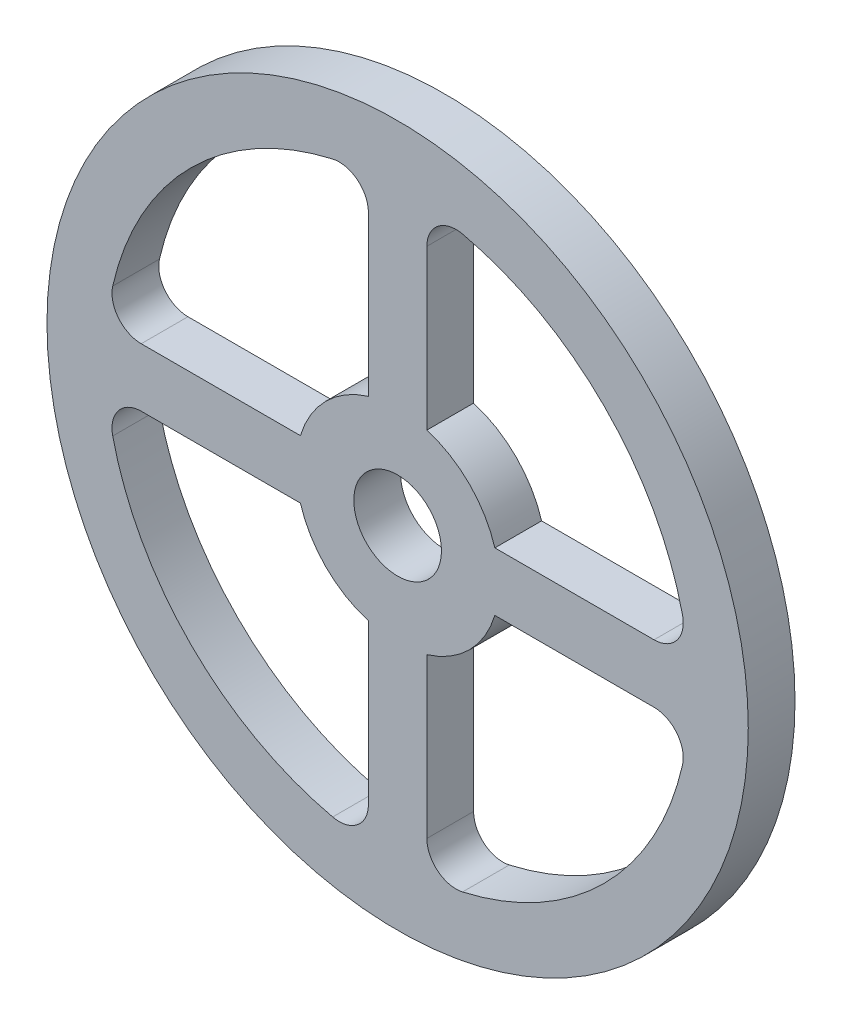
ISO-10303-21;
HEADER;
FILE_DESCRIPTION(('STEP AP214'),'2;1');
FILE_NAME('part.step','',(''),(''),'','','');
FILE_SCHEMA(('AUTOMOTIVE_DESIGN { 1 0 10303 214 1 1 1 1 }'));
ENDSEC;
DATA;
#1=APPLICATION_CONTEXT('core data for automotive mechanical design processes');
#2=APPLICATION_PROTOCOL_DEFINITION('international standard','automotive_design',2000,#1);
#3=PRODUCT_CONTEXT('',#1,'mechanical');
#4=PRODUCT('Part','Part','',(#3));
#5=PRODUCT_RELATED_PRODUCT_CATEGORY('part','',(#4));
#6=PRODUCT_DEFINITION_FORMATION('','',#4);
#7=PRODUCT_DEFINITION_CONTEXT('part definition',#1,'design');
#8=PRODUCT_DEFINITION('design','',#6,#7);
#9=PRODUCT_DEFINITION_SHAPE('','',#8);
#10=(LENGTH_UNIT() NAMED_UNIT(*) SI_UNIT(.MILLI.,.METRE.));
#11=(NAMED_UNIT(*) PLANE_ANGLE_UNIT() SI_UNIT($,.RADIAN.));
#12=(NAMED_UNIT(*) SI_UNIT($,.STERADIAN.) SOLID_ANGLE_UNIT());
#13=UNCERTAINTY_MEASURE_WITH_UNIT(LENGTH_MEASURE(1.E-05),#10,'distance_accuracy_value','');
#14=(GEOMETRIC_REPRESENTATION_CONTEXT(3) GLOBAL_UNCERTAINTY_ASSIGNED_CONTEXT((#13)) GLOBAL_UNIT_ASSIGNED_CONTEXT((#10,
#11,#12)) REPRESENTATION_CONTEXT('',''));
#15=CARTESIAN_POINT('',(0.,0.,0.));
#16=DIRECTION('',(0.,0.,1.));
#17=DIRECTION('',(1.,0.,0.));
#18=AXIS2_PLACEMENT_3D('',#15,#16,#17);
#19=CARTESIAN_POINT('',(0.,0.,16.));
#20=DIRECTION('',(0.,0.,1.));
#21=DIRECTION('',(1.,0.,0.));
#22=AXIS2_PLACEMENT_3D('',#19,#20,#21);
#23=PLANE('',#22);
#24=DIRECTION('',(-1.,0.,0.));
#25=VECTOR('',#24,1.);
#26=CARTESIAN_POINT('',(33.2681518949643,-9.99999999999999,16.));
#27=LINE('',#26,#25);
#28=CARTESIAN_POINT('',(87.7454370086416,-9.99999999999999,16.));
#29=VERTEX_POINT('',#28);
#30=CARTESIAN_POINT('',(33.2681518949643,-9.99999999999999,16.));
#31=VERTEX_POINT('',#30);
#32=EDGE_CURVE('E347',#29,#31,#27,.T.);
#33=ORIENTED_EDGE('',*,*,#32,.F.);
#34=CARTESIAN_POINT('',(87.7454370086416,-20.,16.));
#35=DIRECTION('',(0.,0.,1.));
#36=DIRECTION('',(-1.,0.,0.));
#37=AXIS2_PLACEMENT_3D('',#34,#35,#36);
#38=CIRCLE('',#37,10.);
#39=CARTESIAN_POINT('',(97.4953743545621,-22.2223235026934,16.));
#40=VERTEX_POINT('',#39);
#41=EDGE_CURVE('E345',#40,#29,#38,.T.);
#42=ORIENTED_EDGE('',*,*,#41,.F.);
#43=CARTESIAN_POINT('',(0.,0.,16.));
#44=DIRECTION('',(0.,0.,1.));
#45=DIRECTION('',(1.,0.,0.));
#46=AXIS2_PLACEMENT_3D('',#43,#44,#45);
#47=CIRCLE('',#46,99.9958983278543);
#48=CARTESIAN_POINT('',(22.2223235026933,-97.4953743545622,16.));
#49=VERTEX_POINT('',#48);
#50=EDGE_CURVE('E357',#49,#40,#47,.T.);
#51=ORIENTED_EDGE('',*,*,#50,.F.);
#52=CARTESIAN_POINT('',(19.9999999999999,-87.7454370086416,16.));
#53=DIRECTION('',(0.,0.,1.));
#54=DIRECTION('',(1.,0.,0.));
#55=AXIS2_PLACEMENT_3D('',#52,#53,#54);
#56=CIRCLE('',#55,10.);
#57=CARTESIAN_POINT('',(9.99999999999991,-87.7454370086416,16.));
#58=VERTEX_POINT('',#57);
#59=EDGE_CURVE('E354',#58,#49,#56,.T.);
#60=ORIENTED_EDGE('',*,*,#59,.F.);
#61=DIRECTION('',(0.,-1.,0.));
#62=VECTOR('',#61,1.);
#63=CARTESIAN_POINT('',(9.99999999999991,-33.2681518949644,16.));
#64=LINE('',#63,#62);
#65=CARTESIAN_POINT('',(9.9999999999999,-33.2681518949643,16.));
#66=VERTEX_POINT('',#65);
#67=EDGE_CURVE('E352',#66,#58,#64,.T.);
#68=ORIENTED_EDGE('',*,*,#67,.F.);
#69=CARTESIAN_POINT('',(0.,0.,16.));
#70=DIRECTION('',(0.,0.,-1.));
#71=DIRECTION('',(1.,0.,0.));
#72=AXIS2_PLACEMENT_3D('',#69,#70,#71);
#73=CIRCLE('',#72,34.7385942505798);
#74=EDGE_CURVE('E350',#31,#66,#73,.T.);
#75=ORIENTED_EDGE('',*,*,#74,.F.);
#76=EDGE_LOOP('',(#33,#42,#51,#60,#68,#75));
#77=FACE_BOUND('',#76,.T.);
#78=CARTESIAN_POINT('',(0.,0.,16.));
#79=DIRECTION('',(0.,0.,1.));
#80=DIRECTION('',(1.,0.,0.));
#81=AXIS2_PLACEMENT_3D('',#78,#79,#80);
#82=CIRCLE('',#81,120.);
#83=CARTESIAN_POINT('',(120.,0.,16.));
#84=VERTEX_POINT('',#83);
#85=EDGE_CURVE('E11',#84,#84,#82,.T.);
#86=ORIENTED_EDGE('',*,*,#85,.T.);
#87=EDGE_LOOP('',(#86));
#88=FACE_BOUND('',#87,.T.);
#89=CARTESIAN_POINT('',(0.,0.,16.));
#90=DIRECTION('',(0.,0.,1.));
#91=DIRECTION('',(1.,0.,0.));
#92=AXIS2_PLACEMENT_3D('',#89,#90,#91);
#93=CIRCLE('',#92,15.);
#94=CARTESIAN_POINT('',(15.,0.,16.));
#95=VERTEX_POINT('',#94);
#96=EDGE_CURVE('E339',#95,#95,#93,.T.);
#97=ORIENTED_EDGE('',*,*,#96,.F.);
#98=EDGE_LOOP('',(#97));
#99=FACE_BOUND('',#98,.T.);
#100=DIRECTION('',(1.,0.,0.));
#101=VECTOR('',#100,1.);
#102=CARTESIAN_POINT('',(33.2681518949643,10.,16.));
#103=LINE('',#102,#101);
#104=CARTESIAN_POINT('',(33.2681518949643,10.,16.));
#105=VERTEX_POINT('',#104);
#106=CARTESIAN_POINT('',(87.7454370086416,10.,16.));
#107=VERTEX_POINT('',#106);
#108=EDGE_CURVE('E296',#105,#107,#103,.T.);
#109=ORIENTED_EDGE('',*,*,#108,.F.);
#110=CARTESIAN_POINT('',(0.,0.,16.));
#111=DIRECTION('',(0.,0.,-1.));
#112=DIRECTION('',(1.,0.,0.));
#113=AXIS2_PLACEMENT_3D('',#110,#111,#112);
#114=CIRCLE('',#113,34.7385942505798);
#115=CARTESIAN_POINT('',(9.99999999999991,33.2681518949644,16.));
#116=VERTEX_POINT('',#115);
#117=EDGE_CURVE('E294',#116,#105,#114,.T.);
#118=ORIENTED_EDGE('',*,*,#117,.F.);
#119=DIRECTION('',(0.,-1.,0.));
#120=VECTOR('',#119,1.);
#121=CARTESIAN_POINT('',(9.99999999999991,87.7454370086416,16.));
#122=LINE('',#121,#120);
#123=CARTESIAN_POINT('',(9.99999999999991,87.7454370086416,16.));
#124=VERTEX_POINT('',#123);
#125=EDGE_CURVE('E306',#124,#116,#122,.T.);
#126=ORIENTED_EDGE('',*,*,#125,.F.);
#127=CARTESIAN_POINT('',(19.9999999999999,87.7454370086416,16.));
#128=DIRECTION('',(0.,0.,1.));
#129=DIRECTION('',(-1.,0.,0.));
#130=AXIS2_PLACEMENT_3D('',#127,#128,#129);
#131=CIRCLE('',#130,10.);
#132=CARTESIAN_POINT('',(22.2223235026933,97.4953743545622,16.));
#133=VERTEX_POINT('',#132);
#134=EDGE_CURVE('E303',#133,#124,#131,.T.);
#135=ORIENTED_EDGE('',*,*,#134,.F.);
#136=CARTESIAN_POINT('',(0.,0.,16.));
#137=DIRECTION('',(0.,0.,1.));
#138=DIRECTION('',(1.,0.,0.));
#139=AXIS2_PLACEMENT_3D('',#136,#137,#138);
#140=CIRCLE('',#139,99.9958983278543);
#141=CARTESIAN_POINT('',(97.4953743545621,22.2223235026934,16.));
#142=VERTEX_POINT('',#141);
#143=EDGE_CURVE('E301',#142,#133,#140,.T.);
#144=ORIENTED_EDGE('',*,*,#143,.F.);
#145=CARTESIAN_POINT('',(87.7454370086416,20.,16.));
#146=DIRECTION('',(0.,0.,1.));
#147=DIRECTION('',(1.,0.,0.));
#148=AXIS2_PLACEMENT_3D('',#145,#146,#147);
#149=CIRCLE('',#148,9.99999999999998);
#150=EDGE_CURVE('E299',#107,#142,#149,.T.);
#151=ORIENTED_EDGE('',*,*,#150,.F.);
#152=EDGE_LOOP('',(#109,#118,#126,#135,#144,#151));
#153=FACE_BOUND('',#152,.T.);
#154=DIRECTION('',(0.,1.,0.));
#155=VECTOR('',#154,1.);
#156=CARTESIAN_POINT('',(-10.0000000000001,87.7454370086415,16.));
#157=LINE('',#156,#155);
#158=CARTESIAN_POINT('',(-10.0000000000001,33.2681518949643,16.));
#159=VERTEX_POINT('',#158);
#160=CARTESIAN_POINT('',(-10.0000000000001,87.7454370086415,16.));
#161=VERTEX_POINT('',#160);
#162=EDGE_CURVE('E251',#159,#161,#157,.T.);
#163=ORIENTED_EDGE('',*,*,#162,.F.);
#164=CARTESIAN_POINT('',(0.,0.,16.));
#165=DIRECTION('',(0.,0.,-1.));
#166=DIRECTION('',(1.,0.,0.));
#167=AXIS2_PLACEMENT_3D('',#164,#165,#166);
#168=CIRCLE('',#167,34.7385942505798);
#169=CARTESIAN_POINT('',(-33.2681518949643,10.,16.));
#170=VERTEX_POINT('',#169);
#171=EDGE_CURVE('E249',#170,#159,#168,.T.);
#172=ORIENTED_EDGE('',*,*,#171,.F.);
#173=DIRECTION('',(1.,0.,0.));
#174=VECTOR('',#173,1.);
#175=CARTESIAN_POINT('',(-87.7454370086416,10.,16.));
#176=LINE('',#175,#174);
#177=CARTESIAN_POINT('',(-87.7454370086416,10.,16.));
#178=VERTEX_POINT('',#177);
#179=EDGE_CURVE('E261',#178,#170,#176,.T.);
#180=ORIENTED_EDGE('',*,*,#179,.F.);
#181=CARTESIAN_POINT('',(-87.7454370086416,20.,16.));
#182=DIRECTION('',(0.,0.,1.));
#183=DIRECTION('',(-1.,0.,0.));
#184=AXIS2_PLACEMENT_3D('',#181,#182,#183);
#185=CIRCLE('',#184,9.99999999999998);
#186=CARTESIAN_POINT('',(-97.4953743545621,22.2223235026934,16.));
#187=VERTEX_POINT('',#186);
#188=EDGE_CURVE('E258',#187,#178,#185,.T.);
#189=ORIENTED_EDGE('',*,*,#188,.F.);
#190=CARTESIAN_POINT('',(0.,0.,16.));
#191=DIRECTION('',(0.,0.,1.));
#192=DIRECTION('',(1.,0.,0.));
#193=AXIS2_PLACEMENT_3D('',#190,#191,#192);
#194=CIRCLE('',#193,99.9958983278543);
#195=CARTESIAN_POINT('',(-22.2223235026935,97.4953743545621,16.));
#196=VERTEX_POINT('',#195);
#197=EDGE_CURVE('E256',#196,#187,#194,.T.);
#198=ORIENTED_EDGE('',*,*,#197,.F.);
#199=CARTESIAN_POINT('',(-20.0000000000001,87.7454370086415,16.));
#200=DIRECTION('',(0.,0.,1.));
#201=DIRECTION('',(1.,0.,0.));
#202=AXIS2_PLACEMENT_3D('',#199,#200,#201);
#203=CIRCLE('',#202,10.);
#204=EDGE_CURVE('E254',#161,#196,#203,.T.);
#205=ORIENTED_EDGE('',*,*,#204,.F.);
#206=EDGE_LOOP('',(#163,#172,#180,#189,#198,#205));
#207=FACE_BOUND('',#206,.T.);
#208=DIRECTION('',(-1.,0.,0.));
#209=VECTOR('',#208,1.);
#210=CARTESIAN_POINT('',(-87.7454370086416,-9.99999999999999,16.));
#211=LINE('',#210,#209);
#212=CARTESIAN_POINT('',(-33.2681518949643,-9.99999999999999,16.));
#213=VERTEX_POINT('',#212);
#214=CARTESIAN_POINT('',(-87.7454370086416,-9.99999999999999,16.));
#215=VERTEX_POINT('',#214);
#216=EDGE_CURVE('E206',#213,#215,#211,.T.);
#217=ORIENTED_EDGE('',*,*,#216,.F.);
#218=CARTESIAN_POINT('',(0.,0.,16.));
#219=DIRECTION('',(0.,0.,-1.));
#220=DIRECTION('',(1.,0.,0.));
#221=AXIS2_PLACEMENT_3D('',#218,#219,#220);
#222=CIRCLE('',#221,34.7385942505798);
#223=CARTESIAN_POINT('',(-10.0000000000001,-33.2681518949643,16.));
#224=VERTEX_POINT('',#223);
#225=EDGE_CURVE('E198',#224,#213,#222,.T.);
#226=ORIENTED_EDGE('',*,*,#225,.F.);
#227=DIRECTION('',(0.,1.,0.));
#228=VECTOR('',#227,1.);
#229=CARTESIAN_POINT('',(-10.0000000000001,-33.2681518949643,16.));
#230=LINE('',#229,#228);
#231=CARTESIAN_POINT('',(-10.0000000000001,-87.7454370086415,16.));
#232=VERTEX_POINT('',#231);
#233=EDGE_CURVE('E227',#232,#224,#230,.T.);
#234=ORIENTED_EDGE('',*,*,#233,.F.);
#235=CARTESIAN_POINT('',(-20.0000000000001,-87.7454370086415,16.));
#236=DIRECTION('',(0.,0.,1.));
#237=DIRECTION('',(-1.,0.,0.));
#238=AXIS2_PLACEMENT_3D('',#235,#236,#237);
#239=CIRCLE('',#238,10.);
#240=CARTESIAN_POINT('',(-22.2223235026935,-97.4953743545621,16.));
#241=VERTEX_POINT('',#240);
#242=EDGE_CURVE('E225',#241,#232,#239,.T.);
#243=ORIENTED_EDGE('',*,*,#242,.F.);
#244=CARTESIAN_POINT('',(0.,0.,16.));
#245=DIRECTION('',(0.,0.,1.));
#246=DIRECTION('',(1.,0.,0.));
#247=AXIS2_PLACEMENT_3D('',#244,#245,#246);
#248=CIRCLE('',#247,99.9958983278543);
#249=CARTESIAN_POINT('',(-97.4953743545621,-22.2223235026934,16.));
#250=VERTEX_POINT('',#249);
#251=EDGE_CURVE('E221',#250,#241,#248,.T.);
#252=ORIENTED_EDGE('',*,*,#251,.F.);
#253=CARTESIAN_POINT('',(-87.7454370086416,-20.,16.));
#254=DIRECTION('',(0.,0.,1.));
#255=DIRECTION('',(1.,0.,0.));
#256=AXIS2_PLACEMENT_3D('',#253,#254,#255);
#257=CIRCLE('',#256,10.);
#258=EDGE_CURVE('E219',#215,#250,#257,.T.);
#259=ORIENTED_EDGE('',*,*,#258,.F.);
#260=EDGE_LOOP('',(#217,#226,#234,#243,#252,#259));
#261=FACE_BOUND('',#260,.T.);
#262=ADVANCED_FACE('F37',(#77,#88,#99,#153,#207,#261),#23,.T.);
#263=CARTESIAN_POINT('',(0.,0.,0.));
#264=DIRECTION('',(0.,0.,1.));
#265=DIRECTION('',(1.,0.,0.));
#266=AXIS2_PLACEMENT_3D('',#263,#264,#265);
#267=PLANE('',#266);
#268=CARTESIAN_POINT('',(0.,0.,0.));
#269=DIRECTION('',(0.,0.,-1.));
#270=DIRECTION('',(1.,0.,0.));
#271=AXIS2_PLACEMENT_3D('',#268,#269,#270);
#272=CIRCLE('',#271,34.7385942505798);
#273=CARTESIAN_POINT('',(-33.2681518949643,10.,0.));
#274=VERTEX_POINT('',#273);
#275=CARTESIAN_POINT('',(-10.0000000000001,33.2681518949643,0.));
#276=VERTEX_POINT('',#275);
#277=EDGE_CURVE('E214',#274,#276,#272,.T.);
#278=ORIENTED_EDGE('',*,*,#277,.T.);
#279=DIRECTION('',(0.,1.,0.));
#280=VECTOR('',#279,1.);
#281=CARTESIAN_POINT('',(-10.0000000000001,87.7454370086415,0.));
#282=LINE('',#281,#280);
#283=CARTESIAN_POINT('',(-10.0000000000001,87.7454370086415,0.));
#284=VERTEX_POINT('',#283);
#285=EDGE_CURVE('E266',#276,#284,#282,.T.);
#286=ORIENTED_EDGE('',*,*,#285,.T.);
#287=CARTESIAN_POINT('',(-20.0000000000001,87.7454370086415,0.));
#288=DIRECTION('',(0.,0.,1.));
#289=DIRECTION('',(1.,0.,0.));
#290=AXIS2_PLACEMENT_3D('',#287,#288,#289);
#291=CIRCLE('',#290,10.);
#292=CARTESIAN_POINT('',(-22.2223235026935,97.4953743545621,0.));
#293=VERTEX_POINT('',#292);
#294=EDGE_CURVE('E269',#284,#293,#291,.T.);
#295=ORIENTED_EDGE('',*,*,#294,.T.);
#296=CARTESIAN_POINT('',(0.,0.,0.));
#297=DIRECTION('',(0.,0.,1.));
#298=DIRECTION('',(1.,0.,0.));
#299=AXIS2_PLACEMENT_3D('',#296,#297,#298);
#300=CIRCLE('',#299,99.9958983278543);
#301=CARTESIAN_POINT('',(-97.4953743545621,22.2223235026934,0.));
#302=VERTEX_POINT('',#301);
#303=EDGE_CURVE('E272',#293,#302,#300,.T.);
#304=ORIENTED_EDGE('',*,*,#303,.T.);
#305=CARTESIAN_POINT('',(-87.7454370086416,20.,0.));
#306=DIRECTION('',(0.,0.,1.));
#307=DIRECTION('',(-1.,0.,0.));
#308=AXIS2_PLACEMENT_3D('',#305,#306,#307);
#309=CIRCLE('',#308,9.99999999999998);
#310=CARTESIAN_POINT('',(-87.7454370086416,10.,0.));
#311=VERTEX_POINT('',#310);
#312=EDGE_CURVE('E275',#302,#311,#309,.T.);
#313=ORIENTED_EDGE('',*,*,#312,.T.);
#314=DIRECTION('',(1.,0.,0.));
#315=VECTOR('',#314,1.);
#316=CARTESIAN_POINT('',(-87.7454370086416,10.,0.));
#317=LINE('',#316,#315);
#318=EDGE_CURVE('E252',#311,#274,#317,.T.);
#319=ORIENTED_EDGE('',*,*,#318,.T.);
#320=EDGE_LOOP('',(#278,#286,#295,#304,#313,#319));
#321=FACE_BOUND('',#320,.T.);
#322=CARTESIAN_POINT('',(0.,0.,0.));
#323=DIRECTION('',(0.,0.,1.));
#324=DIRECTION('',(1.,0.,0.));
#325=AXIS2_PLACEMENT_3D('',#322,#323,#324);
#326=CIRCLE('',#325,15.);
#327=CARTESIAN_POINT('',(15.,0.,0.));
#328=VERTEX_POINT('',#327);
#329=EDGE_CURVE('E338',#328,#328,#326,.T.);
#330=ORIENTED_EDGE('',*,*,#329,.T.);
#331=EDGE_LOOP('',(#330));
#332=FACE_BOUND('',#331,.T.);
#333=CARTESIAN_POINT('',(87.7454370086416,-20.,0.));
#334=DIRECTION('',(0.,0.,1.));
#335=DIRECTION('',(-1.,0.,0.));
#336=AXIS2_PLACEMENT_3D('',#333,#334,#335);
#337=CIRCLE('',#336,10.);
#338=CARTESIAN_POINT('',(97.4953743545621,-22.2223235026934,0.));
#339=VERTEX_POINT('',#338);
#340=CARTESIAN_POINT('',(87.7454370086416,-9.99999999999999,0.));
#341=VERTEX_POINT('',#340);
#342=EDGE_CURVE('E342',#339,#341,#337,.T.);
#343=ORIENTED_EDGE('',*,*,#342,.T.);
#344=DIRECTION('',(-1.,0.,0.));
#345=VECTOR('',#344,1.);
#346=CARTESIAN_POINT('',(33.2681518949643,-9.99999999999999,0.));
#347=LINE('',#346,#345);
#348=CARTESIAN_POINT('',(33.2681518949643,-9.99999999999999,0.));
#349=VERTEX_POINT('',#348);
#350=EDGE_CURVE('E362',#341,#349,#347,.T.);
#351=ORIENTED_EDGE('',*,*,#350,.T.);
#352=CARTESIAN_POINT('',(0.,0.,0.));
#353=DIRECTION('',(0.,0.,-1.));
#354=DIRECTION('',(1.,0.,0.));
#355=AXIS2_PLACEMENT_3D('',#352,#353,#354);
#356=CIRCLE('',#355,34.7385942505798);
#357=CARTESIAN_POINT('',(9.9999999999999,-33.2681518949643,0.));
#358=VERTEX_POINT('',#357);
#359=EDGE_CURVE('E365',#349,#358,#356,.T.);
#360=ORIENTED_EDGE('',*,*,#359,.T.);
#361=DIRECTION('',(0.,-1.,0.));
#362=VECTOR('',#361,1.);
#363=CARTESIAN_POINT('',(9.99999999999991,-33.2681518949644,0.));
#364=LINE('',#363,#362);
#365=CARTESIAN_POINT('',(9.99999999999991,-87.7454370086416,0.));
#366=VERTEX_POINT('',#365);
#367=EDGE_CURVE('E368',#358,#366,#364,.T.);
#368=ORIENTED_EDGE('',*,*,#367,.T.);
#369=CARTESIAN_POINT('',(19.9999999999999,-87.7454370086416,0.));
#370=DIRECTION('',(0.,0.,1.));
#371=DIRECTION('',(1.,0.,0.));
#372=AXIS2_PLACEMENT_3D('',#369,#370,#371);
#373=CIRCLE('',#372,10.);
#374=CARTESIAN_POINT('',(22.2223235026933,-97.4953743545622,0.));
#375=VERTEX_POINT('',#374);
#376=EDGE_CURVE('E371',#366,#375,#373,.T.);
#377=ORIENTED_EDGE('',*,*,#376,.T.);
#378=CARTESIAN_POINT('',(0.,0.,0.));
#379=DIRECTION('',(0.,0.,1.));
#380=DIRECTION('',(1.,0.,0.));
#381=AXIS2_PLACEMENT_3D('',#378,#379,#380);
#382=CIRCLE('',#381,99.9958983278543);
#383=EDGE_CURVE('E348',#375,#339,#382,.T.);
#384=ORIENTED_EDGE('',*,*,#383,.T.);
#385=EDGE_LOOP('',(#343,#351,#360,#368,#377,#384));
#386=FACE_BOUND('',#385,.T.);
#387=CARTESIAN_POINT('',(0.,0.,0.));
#388=DIRECTION('',(0.,0.,1.));
#389=DIRECTION('',(1.,0.,0.));
#390=AXIS2_PLACEMENT_3D('',#387,#388,#389);
#391=CIRCLE('',#390,120.);
#392=CARTESIAN_POINT('',(120.,0.,0.));
#393=VERTEX_POINT('',#392);
#394=EDGE_CURVE('E41',#393,#393,#391,.T.);
#395=ORIENTED_EDGE('',*,*,#394,.F.);
#396=EDGE_LOOP('',(#395));
#397=FACE_BOUND('',#396,.T.);
#398=CARTESIAN_POINT('',(0.,0.,0.));
#399=DIRECTION('',(0.,0.,-1.));
#400=DIRECTION('',(1.,0.,0.));
#401=AXIS2_PLACEMENT_3D('',#398,#399,#400);
#402=CIRCLE('',#401,34.7385942505798);
#403=CARTESIAN_POINT('',(9.99999999999991,33.2681518949644,0.));
#404=VERTEX_POINT('',#403);
#405=CARTESIAN_POINT('',(33.2681518949643,10.,0.));
#406=VERTEX_POINT('',#405);
#407=EDGE_CURVE('E293',#404,#406,#402,.T.);
#408=ORIENTED_EDGE('',*,*,#407,.T.);
#409=DIRECTION('',(1.,0.,0.));
#410=VECTOR('',#409,1.);
#411=CARTESIAN_POINT('',(33.2681518949643,10.,0.));
#412=LINE('',#411,#410);
#413=CARTESIAN_POINT('',(87.7454370086416,10.,0.));
#414=VERTEX_POINT('',#413);
#415=EDGE_CURVE('E311',#406,#414,#412,.T.);
#416=ORIENTED_EDGE('',*,*,#415,.T.);
#417=CARTESIAN_POINT('',(87.7454370086416,20.,0.));
#418=DIRECTION('',(0.,0.,1.));
#419=DIRECTION('',(1.,0.,0.));
#420=AXIS2_PLACEMENT_3D('',#417,#418,#419);
#421=CIRCLE('',#420,9.99999999999998);
#422=CARTESIAN_POINT('',(97.4953743545621,22.2223235026934,0.));
#423=VERTEX_POINT('',#422);
#424=EDGE_CURVE('E314',#414,#423,#421,.T.);
#425=ORIENTED_EDGE('',*,*,#424,.T.);
#426=CARTESIAN_POINT('',(0.,0.,0.));
#427=DIRECTION('',(0.,0.,1.));
#428=DIRECTION('',(1.,0.,0.));
#429=AXIS2_PLACEMENT_3D('',#426,#427,#428);
#430=CIRCLE('',#429,99.9958983278543);
#431=CARTESIAN_POINT('',(22.2223235026933,97.4953743545622,0.));
#432=VERTEX_POINT('',#431);
#433=EDGE_CURVE('E317',#423,#432,#430,.T.);
#434=ORIENTED_EDGE('',*,*,#433,.T.);
#435=CARTESIAN_POINT('',(19.9999999999999,87.7454370086416,0.));
#436=DIRECTION('',(0.,0.,1.));
#437=DIRECTION('',(-1.,0.,0.));
#438=AXIS2_PLACEMENT_3D('',#435,#436,#437);
#439=CIRCLE('',#438,10.);
#440=CARTESIAN_POINT('',(9.99999999999991,87.7454370086416,0.));
#441=VERTEX_POINT('',#440);
#442=EDGE_CURVE('E320',#432,#441,#439,.T.);
#443=ORIENTED_EDGE('',*,*,#442,.T.);
#444=DIRECTION('',(0.,-1.,0.));
#445=VECTOR('',#444,1.);
#446=CARTESIAN_POINT('',(9.99999999999991,87.7454370086416,0.));
#447=LINE('',#446,#445);
#448=EDGE_CURVE('E297',#441,#404,#447,.T.);
#449=ORIENTED_EDGE('',*,*,#448,.T.);
#450=EDGE_LOOP('',(#408,#416,#425,#434,#443,#449));
#451=FACE_BOUND('',#450,.T.);
#452=CARTESIAN_POINT('',(0.,0.,0.));
#453=DIRECTION('',(0.,0.,-1.));
#454=DIRECTION('',(1.,0.,0.));
#455=AXIS2_PLACEMENT_3D('',#452,#453,#454);
#456=CIRCLE('',#455,34.7385942505798);
#457=CARTESIAN_POINT('',(-10.0000000000001,-33.2681518949643,0.));
#458=VERTEX_POINT('',#457);
#459=CARTESIAN_POINT('',(-33.2681518949643,-9.99999999999999,0.));
#460=VERTEX_POINT('',#459);
#461=EDGE_CURVE('E60',#458,#460,#456,.T.);
#462=ORIENTED_EDGE('',*,*,#461,.T.);
#463=DIRECTION('',(-1.,0.,0.));
#464=VECTOR('',#463,1.);
#465=CARTESIAN_POINT('',(-87.7454370086416,-9.99999999999999,0.));
#466=LINE('',#465,#464);
#467=CARTESIAN_POINT('',(-87.7454370086416,-9.99999999999999,0.));
#468=VERTEX_POINT('',#467);
#469=EDGE_CURVE('E213',#460,#468,#466,.T.);
#470=ORIENTED_EDGE('',*,*,#469,.T.);
#471=CARTESIAN_POINT('',(-87.7454370086416,-20.,0.));
#472=DIRECTION('',(0.,0.,1.));
#473=DIRECTION('',(1.,0.,0.));
#474=AXIS2_PLACEMENT_3D('',#471,#472,#473);
#475=CIRCLE('',#474,10.);
#476=CARTESIAN_POINT('',(-97.4953743545621,-22.2223235026934,0.));
#477=VERTEX_POINT('',#476);
#478=EDGE_CURVE('E231',#468,#477,#475,.T.);
#479=ORIENTED_EDGE('',*,*,#478,.T.);
#480=CARTESIAN_POINT('',(0.,0.,0.));
#481=DIRECTION('',(0.,0.,1.));
#482=DIRECTION('',(1.,0.,0.));
#483=AXIS2_PLACEMENT_3D('',#480,#481,#482);
#484=CIRCLE('',#483,99.9958983278543);
#485=CARTESIAN_POINT('',(-22.2223235026935,-97.4953743545621,0.));
#486=VERTEX_POINT('',#485);
#487=EDGE_CURVE('E234',#477,#486,#484,.T.);
#488=ORIENTED_EDGE('',*,*,#487,.T.);
#489=CARTESIAN_POINT('',(-20.0000000000001,-87.7454370086415,0.));
#490=DIRECTION('',(0.,0.,1.));
#491=DIRECTION('',(-1.,0.,0.));
#492=AXIS2_PLACEMENT_3D('',#489,#490,#491);
#493=CIRCLE('',#492,10.);
#494=CARTESIAN_POINT('',(-10.0000000000001,-87.7454370086415,0.));
#495=VERTEX_POINT('',#494);
#496=EDGE_CURVE('E237',#486,#495,#493,.T.);
#497=ORIENTED_EDGE('',*,*,#496,.T.);
#498=DIRECTION('',(0.,1.,0.));
#499=VECTOR('',#498,1.);
#500=CARTESIAN_POINT('',(-10.0000000000001,-33.2681518949643,0.));
#501=LINE('',#500,#499);
#502=EDGE_CURVE('E207',#495,#458,#501,.T.);
#503=ORIENTED_EDGE('',*,*,#502,.T.);
#504=EDGE_LOOP('',(#462,#470,#479,#488,#497,#503));
#505=FACE_BOUND('',#504,.T.);
#506=ADVANCED_FACE('F394',(#321,#332,#386,#397,#451,#505),#267,.F.);
#507=CARTESIAN_POINT('',(0.,0.,16.));
#508=DIRECTION('',(0.,0.,-1.));
#509=DIRECTION('',(-1.,0.,0.));
#510=AXIS2_PLACEMENT_3D('',#507,#508,#509);
#511=CYLINDRICAL_SURFACE('',#510,120.);
#512=ORIENTED_EDGE('',*,*,#85,.F.);
#513=EDGE_LOOP('',(#512));
#514=FACE_BOUND('',#513,.T.);
#515=ORIENTED_EDGE('',*,*,#394,.T.);
#516=EDGE_LOOP('',(#515));
#517=FACE_BOUND('',#516,.T.);
#518=ADVANCED_FACE('F39',(#514,#517),#511,.T.);
#519=CARTESIAN_POINT('',(87.7454370086416,-20.,16.));
#520=DIRECTION('',(0.,0.,-1.));
#521=DIRECTION('',(-1.,0.,0.));
#522=AXIS2_PLACEMENT_3D('',#519,#520,#521);
#523=CYLINDRICAL_SURFACE('',#522,10.);
#524=ORIENTED_EDGE('',*,*,#342,.F.);
#525=DIRECTION('',(0.,0.,-1.));
#526=VECTOR('',#525,1.);
#527=CARTESIAN_POINT('',(97.4953743545621,-22.2223235026934,16.));
#528=LINE('',#527,#526);
#529=EDGE_CURVE('E359',#40,#339,#528,.T.);
#530=ORIENTED_EDGE('',*,*,#529,.F.);
#531=ORIENTED_EDGE('',*,*,#41,.T.);
#532=DIRECTION('',(0.,0.,-1.));
#533=VECTOR('',#532,1.);
#534=CARTESIAN_POINT('',(87.7454370086416,-9.99999999999999,16.));
#535=LINE('',#534,#533);
#536=EDGE_CURVE('E386',#29,#341,#535,.T.);
#537=ORIENTED_EDGE('',*,*,#536,.T.);
#538=EDGE_LOOP('',(#524,#530,#531,#537));
#539=FACE_BOUND('',#538,.T.);
#540=ADVANCED_FACE('F428',(#539),#523,.F.);
#541=CARTESIAN_POINT('',(33.2681518949643,-9.99999999999999,16.));
#542=DIRECTION('',(0.,-1.,0.));
#543=DIRECTION('',(0.,0.,-1.));
#544=AXIS2_PLACEMENT_3D('',#541,#542,#543);
#545=PLANE('',#544);
#546=ORIENTED_EDGE('',*,*,#350,.F.);
#547=ORIENTED_EDGE('',*,*,#536,.F.);
#548=ORIENTED_EDGE('',*,*,#32,.T.);
#549=DIRECTION('',(0.,0.,-1.));
#550=VECTOR('',#549,1.);
#551=CARTESIAN_POINT('',(33.2681518949643,-9.99999999999999,16.));
#552=LINE('',#551,#550);
#553=EDGE_CURVE('E384',#31,#349,#552,.T.);
#554=ORIENTED_EDGE('',*,*,#553,.T.);
#555=EDGE_LOOP('',(#546,#547,#548,#554));
#556=FACE_BOUND('',#555,.T.);
#557=ADVANCED_FACE('F431',(#556),#545,.T.);
#558=CARTESIAN_POINT('',(0.,0.,16.));
#559=DIRECTION('',(0.,0.,-1.));
#560=DIRECTION('',(-1.,0.,0.));
#561=AXIS2_PLACEMENT_3D('',#558,#559,#560);
#562=CYLINDRICAL_SURFACE('',#561,34.7385942505798);
#563=ORIENTED_EDGE('',*,*,#359,.F.);
#564=ORIENTED_EDGE('',*,*,#553,.F.);
#565=ORIENTED_EDGE('',*,*,#74,.T.);
#566=DIRECTION('',(0.,0.,-1.));
#567=VECTOR('',#566,1.);
#568=CARTESIAN_POINT('',(9.9999999999999,-33.2681518949643,16.));
#569=LINE('',#568,#567);
#570=EDGE_CURVE('E382',#66,#358,#569,.T.);
#571=ORIENTED_EDGE('',*,*,#570,.T.);
#572=EDGE_LOOP('',(#563,#564,#565,#571));
#573=FACE_BOUND('',#572,.T.);
#574=ADVANCED_FACE('F434',(#573),#562,.T.);
#575=CARTESIAN_POINT('',(9.99999999999991,-33.2681518949644,16.));
#576=DIRECTION('',(1.,0.,0.));
#577=DIRECTION('',(0.,0.,-1.));
#578=AXIS2_PLACEMENT_3D('',#575,#576,#577);
#579=PLANE('',#578);
#580=ORIENTED_EDGE('',*,*,#367,.F.);
#581=ORIENTED_EDGE('',*,*,#570,.F.);
#582=ORIENTED_EDGE('',*,*,#67,.T.);
#583=DIRECTION('',(0.,0.,-1.));
#584=VECTOR('',#583,1.);
#585=CARTESIAN_POINT('',(9.99999999999991,-87.7454370086416,16.));
#586=LINE('',#585,#584);
#587=EDGE_CURVE('E380',#58,#366,#586,.T.);
#588=ORIENTED_EDGE('',*,*,#587,.T.);
#589=EDGE_LOOP('',(#580,#581,#582,#588));
#590=FACE_BOUND('',#589,.T.);
#591=ADVANCED_FACE('F438',(#590),#579,.T.);
#592=CARTESIAN_POINT('',(19.9999999999999,-87.7454370086416,16.));
#593=DIRECTION('',(0.,0.,-1.));
#594=DIRECTION('',(-1.,0.,0.));
#595=AXIS2_PLACEMENT_3D('',#592,#593,#594);
#596=CYLINDRICAL_SURFACE('',#595,10.);
#597=ORIENTED_EDGE('',*,*,#376,.F.);
#598=ORIENTED_EDGE('',*,*,#587,.F.);
#599=ORIENTED_EDGE('',*,*,#59,.T.);
#600=DIRECTION('',(0.,0.,-1.));
#601=VECTOR('',#600,1.);
#602=CARTESIAN_POINT('',(22.2223235026933,-97.4953743545622,16.));
#603=LINE('',#602,#601);
#604=EDGE_CURVE('E378',#49,#375,#603,.T.);
#605=ORIENTED_EDGE('',*,*,#604,.T.);
#606=EDGE_LOOP('',(#597,#598,#599,#605));
#607=FACE_BOUND('',#606,.T.);
#608=ADVANCED_FACE('F442',(#607),#596,.F.);
#609=CARTESIAN_POINT('',(0.,0.,16.));
#610=DIRECTION('',(0.,0.,-1.));
#611=DIRECTION('',(-1.,0.,0.));
#612=AXIS2_PLACEMENT_3D('',#609,#610,#611);
#613=CYLINDRICAL_SURFACE('',#612,99.9958983278543);
#614=ORIENTED_EDGE('',*,*,#383,.F.);
#615=ORIENTED_EDGE('',*,*,#604,.F.);
#616=ORIENTED_EDGE('',*,*,#50,.T.);
#617=ORIENTED_EDGE('',*,*,#529,.T.);
#618=EDGE_LOOP('',(#614,#615,#616,#617));
#619=FACE_BOUND('',#618,.T.);
#620=ADVANCED_FACE('F446',(#619),#613,.F.);
#621=CARTESIAN_POINT('',(0.,0.,16.));
#622=DIRECTION('',(0.,0.,-1.));
#623=DIRECTION('',(-1.,0.,0.));
#624=AXIS2_PLACEMENT_3D('',#621,#622,#623);
#625=CYLINDRICAL_SURFACE('',#624,15.);
#626=ORIENTED_EDGE('',*,*,#96,.T.);
#627=EDGE_LOOP('',(#626));
#628=FACE_BOUND('',#627,.T.);
#629=ORIENTED_EDGE('',*,*,#329,.F.);
#630=EDGE_LOOP('',(#629));
#631=FACE_BOUND('',#630,.T.);
#632=ADVANCED_FACE('F450',(#628,#631),#625,.F.);
#633=CARTESIAN_POINT('',(0.,0.,16.));
#634=DIRECTION('',(0.,0.,-1.));
#635=DIRECTION('',(-1.,0.,0.));
#636=AXIS2_PLACEMENT_3D('',#633,#634,#635);
#637=CYLINDRICAL_SURFACE('',#636,34.7385942505798);
#638=ORIENTED_EDGE('',*,*,#407,.F.);
#639=DIRECTION('',(0.,0.,-1.));
#640=VECTOR('',#639,1.);
#641=CARTESIAN_POINT('',(9.99999999999991,33.2681518949644,16.));
#642=LINE('',#641,#640);
#643=EDGE_CURVE('E308',#116,#404,#642,.T.);
#644=ORIENTED_EDGE('',*,*,#643,.F.);
#645=ORIENTED_EDGE('',*,*,#117,.T.);
#646=DIRECTION('',(0.,0.,-1.));
#647=VECTOR('',#646,1.);
#648=CARTESIAN_POINT('',(33.2681518949643,10.,16.));
#649=LINE('',#648,#647);
#650=EDGE_CURVE('E335',#105,#406,#649,.T.);
#651=ORIENTED_EDGE('',*,*,#650,.T.);
#652=EDGE_LOOP('',(#638,#644,#645,#651));
#653=FACE_BOUND('',#652,.T.);
#654=ADVANCED_FACE('F454',(#653),#637,.T.);
#655=CARTESIAN_POINT('',(33.2681518949643,10.,16.));
#656=DIRECTION('',(0.,1.,0.));
#657=DIRECTION('',(0.,0.,1.));
#658=AXIS2_PLACEMENT_3D('',#655,#656,#657);
#659=PLANE('',#658);
#660=ORIENTED_EDGE('',*,*,#415,.F.);
#661=ORIENTED_EDGE('',*,*,#650,.F.);
#662=ORIENTED_EDGE('',*,*,#108,.T.);
#663=DIRECTION('',(0.,0.,-1.));
#664=VECTOR('',#663,1.);
#665=CARTESIAN_POINT('',(87.7454370086416,10.,16.));
#666=LINE('',#665,#664);
#667=EDGE_CURVE('E333',#107,#414,#666,.T.);
#668=ORIENTED_EDGE('',*,*,#667,.T.);
#669=EDGE_LOOP('',(#660,#661,#662,#668));
#670=FACE_BOUND('',#669,.T.);
#671=ADVANCED_FACE('F458',(#670),#659,.T.);
#672=CARTESIAN_POINT('',(87.7454370086416,20.,16.));
#673=DIRECTION('',(0.,0.,-1.));
#674=DIRECTION('',(-1.,0.,0.));
#675=AXIS2_PLACEMENT_3D('',#672,#673,#674);
#676=CYLINDRICAL_SURFACE('',#675,9.99999999999998);
#677=ORIENTED_EDGE('',*,*,#424,.F.);
#678=ORIENTED_EDGE('',*,*,#667,.F.);
#679=ORIENTED_EDGE('',*,*,#150,.T.);
#680=DIRECTION('',(0.,0.,-1.));
#681=VECTOR('',#680,1.);
#682=CARTESIAN_POINT('',(97.4953743545621,22.2223235026934,16.));
#683=LINE('',#682,#681);
#684=EDGE_CURVE('E331',#142,#423,#683,.T.);
#685=ORIENTED_EDGE('',*,*,#684,.T.);
#686=EDGE_LOOP('',(#677,#678,#679,#685));
#687=FACE_BOUND('',#686,.T.);
#688=ADVANCED_FACE('F462',(#687),#676,.F.);
#689=CARTESIAN_POINT('',(0.,0.,16.));
#690=DIRECTION('',(0.,0.,-1.));
#691=DIRECTION('',(-1.,0.,0.));
#692=AXIS2_PLACEMENT_3D('',#689,#690,#691);
#693=CYLINDRICAL_SURFACE('',#692,99.9958983278543);
#694=ORIENTED_EDGE('',*,*,#433,.F.);
#695=ORIENTED_EDGE('',*,*,#684,.F.);
#696=ORIENTED_EDGE('',*,*,#143,.T.);
#697=DIRECTION('',(0.,0.,-1.));
#698=VECTOR('',#697,1.);
#699=CARTESIAN_POINT('',(22.2223235026933,97.4953743545622,16.));
#700=LINE('',#699,#698);
#701=EDGE_CURVE('E329',#133,#432,#700,.T.);
#702=ORIENTED_EDGE('',*,*,#701,.T.);
#703=EDGE_LOOP('',(#694,#695,#696,#702));
#704=FACE_BOUND('',#703,.T.);
#705=ADVANCED_FACE('F466',(#704),#693,.F.);
#706=CARTESIAN_POINT('',(19.9999999999999,87.7454370086416,16.));
#707=DIRECTION('',(0.,0.,-1.));
#708=DIRECTION('',(-1.,0.,0.));
#709=AXIS2_PLACEMENT_3D('',#706,#707,#708);
#710=CYLINDRICAL_SURFACE('',#709,10.);
#711=ORIENTED_EDGE('',*,*,#442,.F.);
#712=ORIENTED_EDGE('',*,*,#701,.F.);
#713=ORIENTED_EDGE('',*,*,#134,.T.);
#714=DIRECTION('',(0.,0.,-1.));
#715=VECTOR('',#714,1.);
#716=CARTESIAN_POINT('',(9.99999999999991,87.7454370086416,16.));
#717=LINE('',#716,#715);
#718=EDGE_CURVE('E327',#124,#441,#717,.T.);
#719=ORIENTED_EDGE('',*,*,#718,.T.);
#720=EDGE_LOOP('',(#711,#712,#713,#719));
#721=FACE_BOUND('',#720,.T.);
#722=ADVANCED_FACE('F470',(#721),#710,.F.);
#723=CARTESIAN_POINT('',(9.99999999999991,87.7454370086416,16.));
#724=DIRECTION('',(1.,0.,0.));
#725=DIRECTION('',(0.,1.,0.));
#726=AXIS2_PLACEMENT_3D('',#723,#724,#725);
#727=PLANE('',#726);
#728=ORIENTED_EDGE('',*,*,#448,.F.);
#729=ORIENTED_EDGE('',*,*,#718,.F.);
#730=ORIENTED_EDGE('',*,*,#125,.T.);
#731=ORIENTED_EDGE('',*,*,#643,.T.);
#732=EDGE_LOOP('',(#728,#729,#730,#731));
#733=FACE_BOUND('',#732,.T.);
#734=ADVANCED_FACE('F474',(#733),#727,.T.);
#735=CARTESIAN_POINT('',(0.,0.,16.));
#736=DIRECTION('',(0.,0.,-1.));
#737=DIRECTION('',(-1.,0.,0.));
#738=AXIS2_PLACEMENT_3D('',#735,#736,#737);
#739=CYLINDRICAL_SURFACE('',#738,34.7385942505798);
#740=ORIENTED_EDGE('',*,*,#277,.F.);
#741=DIRECTION('',(0.,0.,-1.));
#742=VECTOR('',#741,1.);
#743=CARTESIAN_POINT('',(-33.2681518949643,10.,16.));
#744=LINE('',#743,#742);
#745=EDGE_CURVE('E263',#170,#274,#744,.T.);
#746=ORIENTED_EDGE('',*,*,#745,.F.);
#747=ORIENTED_EDGE('',*,*,#171,.T.);
#748=DIRECTION('',(0.,0.,-1.));
#749=VECTOR('',#748,1.);
#750=CARTESIAN_POINT('',(-10.0000000000001,33.2681518949643,16.));
#751=LINE('',#750,#749);
#752=EDGE_CURVE('E290',#159,#276,#751,.T.);
#753=ORIENTED_EDGE('',*,*,#752,.T.);
#754=EDGE_LOOP('',(#740,#746,#747,#753));
#755=FACE_BOUND('',#754,.T.);
#756=ADVANCED_FACE('F478',(#755),#739,.T.);
#757=CARTESIAN_POINT('',(-10.0000000000001,87.7454370086415,16.));
#758=DIRECTION('',(-1.,0.,0.));
#759=DIRECTION('',(0.,-1.,0.));
#760=AXIS2_PLACEMENT_3D('',#757,#758,#759);
#761=PLANE('',#760);
#762=ORIENTED_EDGE('',*,*,#285,.F.);
#763=ORIENTED_EDGE('',*,*,#752,.F.);
#764=ORIENTED_EDGE('',*,*,#162,.T.);
#765=DIRECTION('',(0.,0.,-1.));
#766=VECTOR('',#765,1.);
#767=CARTESIAN_POINT('',(-10.0000000000001,87.7454370086415,16.));
#768=LINE('',#767,#766);
#769=EDGE_CURVE('E288',#161,#284,#768,.T.);
#770=ORIENTED_EDGE('',*,*,#769,.T.);
#771=EDGE_LOOP('',(#762,#763,#764,#770));
#772=FACE_BOUND('',#771,.T.);
#773=ADVANCED_FACE('F482',(#772),#761,.T.);
#774=CARTESIAN_POINT('',(-20.0000000000001,87.7454370086415,16.));
#775=DIRECTION('',(0.,0.,-1.));
#776=DIRECTION('',(-1.,0.,0.));
#777=AXIS2_PLACEMENT_3D('',#774,#775,#776);
#778=CYLINDRICAL_SURFACE('',#777,10.);
#779=ORIENTED_EDGE('',*,*,#294,.F.);
#780=ORIENTED_EDGE('',*,*,#769,.F.);
#781=ORIENTED_EDGE('',*,*,#204,.T.);
#782=DIRECTION('',(0.,0.,-1.));
#783=VECTOR('',#782,1.);
#784=CARTESIAN_POINT('',(-22.2223235026935,97.4953743545621,16.));
#785=LINE('',#784,#783);
#786=EDGE_CURVE('E286',#196,#293,#785,.T.);
#787=ORIENTED_EDGE('',*,*,#786,.T.);
#788=EDGE_LOOP('',(#779,#780,#781,#787));
#789=FACE_BOUND('',#788,.T.);
#790=ADVANCED_FACE('F486',(#789),#778,.F.);
#791=CARTESIAN_POINT('',(0.,0.,16.));
#792=DIRECTION('',(0.,0.,-1.));
#793=DIRECTION('',(-1.,0.,0.));
#794=AXIS2_PLACEMENT_3D('',#791,#792,#793);
#795=CYLINDRICAL_SURFACE('',#794,99.9958983278543);
#796=ORIENTED_EDGE('',*,*,#303,.F.);
#797=ORIENTED_EDGE('',*,*,#786,.F.);
#798=ORIENTED_EDGE('',*,*,#197,.T.);
#799=DIRECTION('',(0.,0.,-1.));
#800=VECTOR('',#799,1.);
#801=CARTESIAN_POINT('',(-97.4953743545621,22.2223235026934,16.));
#802=LINE('',#801,#800);
#803=EDGE_CURVE('E284',#187,#302,#802,.T.);
#804=ORIENTED_EDGE('',*,*,#803,.T.);
#805=EDGE_LOOP('',(#796,#797,#798,#804));
#806=FACE_BOUND('',#805,.T.);
#807=ADVANCED_FACE('F490',(#806),#795,.F.);
#808=CARTESIAN_POINT('',(-87.7454370086416,20.,16.));
#809=DIRECTION('',(0.,0.,-1.));
#810=DIRECTION('',(-1.,0.,0.));
#811=AXIS2_PLACEMENT_3D('',#808,#809,#810);
#812=CYLINDRICAL_SURFACE('',#811,9.99999999999998);
#813=ORIENTED_EDGE('',*,*,#312,.F.);
#814=ORIENTED_EDGE('',*,*,#803,.F.);
#815=ORIENTED_EDGE('',*,*,#188,.T.);
#816=DIRECTION('',(0.,0.,-1.));
#817=VECTOR('',#816,1.);
#818=CARTESIAN_POINT('',(-87.7454370086416,10.,16.));
#819=LINE('',#818,#817);
#820=EDGE_CURVE('E282',#178,#311,#819,.T.);
#821=ORIENTED_EDGE('',*,*,#820,.T.);
#822=EDGE_LOOP('',(#813,#814,#815,#821));
#823=FACE_BOUND('',#822,.T.);
#824=ADVANCED_FACE('F494',(#823),#812,.F.);
#825=CARTESIAN_POINT('',(-87.7454370086416,10.,16.));
#826=DIRECTION('',(0.,1.,0.));
#827=DIRECTION('',(0.,0.,1.));
#828=AXIS2_PLACEMENT_3D('',#825,#826,#827);
#829=PLANE('',#828);
#830=ORIENTED_EDGE('',*,*,#318,.F.);
#831=ORIENTED_EDGE('',*,*,#820,.F.);
#832=ORIENTED_EDGE('',*,*,#179,.T.);
#833=ORIENTED_EDGE('',*,*,#745,.T.);
#834=EDGE_LOOP('',(#830,#831,#832,#833));
#835=FACE_BOUND('',#834,.T.);
#836=ADVANCED_FACE('F498',(#835),#829,.T.);
#837=CARTESIAN_POINT('',(0.,0.,16.));
#838=DIRECTION('',(0.,0.,-1.));
#839=DIRECTION('',(-1.,0.,0.));
#840=AXIS2_PLACEMENT_3D('',#837,#838,#839);
#841=CYLINDRICAL_SURFACE('',#840,34.7385942505798);
#842=ORIENTED_EDGE('',*,*,#461,.F.);
#843=DIRECTION('',(0.,0.,-1.));
#844=VECTOR('',#843,1.);
#845=CARTESIAN_POINT('',(-10.0000000000001,-33.2681518949643,16.));
#846=LINE('',#845,#844);
#847=EDGE_CURVE('E202',#224,#458,#846,.T.);
#848=ORIENTED_EDGE('',*,*,#847,.F.);
#849=ORIENTED_EDGE('',*,*,#225,.T.);
#850=DIRECTION('',(0.,0.,-1.));
#851=VECTOR('',#850,1.);
#852=CARTESIAN_POINT('',(-33.2681518949643,-9.99999999999999,16.));
#853=LINE('',#852,#851);
#854=EDGE_CURVE('E201',#213,#460,#853,.T.);
#855=ORIENTED_EDGE('',*,*,#854,.T.);
#856=EDGE_LOOP('',(#842,#848,#849,#855));
#857=FACE_BOUND('',#856,.T.);
#858=ADVANCED_FACE('F200',(#857),#841,.T.);
#859=CARTESIAN_POINT('',(-87.7454370086416,-9.99999999999999,16.));
#860=DIRECTION('',(0.,-1.,0.));
#861=DIRECTION('',(0.,0.,-1.));
#862=AXIS2_PLACEMENT_3D('',#859,#860,#861);
#863=PLANE('',#862);
#864=ORIENTED_EDGE('',*,*,#469,.F.);
#865=ORIENTED_EDGE('',*,*,#854,.F.);
#866=ORIENTED_EDGE('',*,*,#216,.T.);
#867=DIRECTION('',(0.,0.,-1.));
#868=VECTOR('',#867,1.);
#869=CARTESIAN_POINT('',(-87.7454370086416,-9.99999999999999,16.));
#870=LINE('',#869,#868);
#871=EDGE_CURVE('E215',#215,#468,#870,.T.);
#872=ORIENTED_EDGE('',*,*,#871,.T.);
#873=EDGE_LOOP('',(#864,#865,#866,#872));
#874=FACE_BOUND('',#873,.T.);
#875=ADVANCED_FACE('F210',(#874),#863,.T.);
#876=CARTESIAN_POINT('',(-87.7454370086416,-20.,16.));
#877=DIRECTION('',(0.,0.,-1.));
#878=DIRECTION('',(-1.,0.,0.));
#879=AXIS2_PLACEMENT_3D('',#876,#877,#878);
#880=CYLINDRICAL_SURFACE('',#879,10.);
#881=ORIENTED_EDGE('',*,*,#478,.F.);
#882=ORIENTED_EDGE('',*,*,#871,.F.);
#883=ORIENTED_EDGE('',*,*,#258,.T.);
#884=DIRECTION('',(0.,0.,-1.));
#885=VECTOR('',#884,1.);
#886=CARTESIAN_POINT('',(-97.4953743545621,-22.2223235026934,16.));
#887=LINE('',#886,#885);
#888=EDGE_CURVE('E246',#250,#477,#887,.T.);
#889=ORIENTED_EDGE('',*,*,#888,.T.);
#890=EDGE_LOOP('',(#881,#882,#883,#889));
#891=FACE_BOUND('',#890,.T.);
#892=ADVANCED_FACE('F411',(#891),#880,.F.);
#893=CARTESIAN_POINT('',(0.,0.,16.));
#894=DIRECTION('',(0.,0.,-1.));
#895=DIRECTION('',(-1.,0.,0.));
#896=AXIS2_PLACEMENT_3D('',#893,#894,#895);
#897=CYLINDRICAL_SURFACE('',#896,99.9958983278543);
#898=ORIENTED_EDGE('',*,*,#487,.F.);
#899=ORIENTED_EDGE('',*,*,#888,.F.);
#900=ORIENTED_EDGE('',*,*,#251,.T.);
#901=DIRECTION('',(0.,0.,-1.));
#902=VECTOR('',#901,1.);
#903=CARTESIAN_POINT('',(-22.2223235026935,-97.4953743545621,16.));
#904=LINE('',#903,#902);
#905=EDGE_CURVE('E244',#241,#486,#904,.T.);
#906=ORIENTED_EDGE('',*,*,#905,.T.);
#907=EDGE_LOOP('',(#898,#899,#900,#906));
#908=FACE_BOUND('',#907,.T.);
#909=ADVANCED_FACE('F407',(#908),#897,.F.);
#910=CARTESIAN_POINT('',(-20.0000000000001,-87.7454370086415,16.));
#911=DIRECTION('',(0.,0.,-1.));
#912=DIRECTION('',(-1.,0.,0.));
#913=AXIS2_PLACEMENT_3D('',#910,#911,#912);
#914=CYLINDRICAL_SURFACE('',#913,10.);
#915=ORIENTED_EDGE('',*,*,#496,.F.);
#916=ORIENTED_EDGE('',*,*,#905,.F.);
#917=ORIENTED_EDGE('',*,*,#242,.T.);
#918=DIRECTION('',(0.,0.,-1.));
#919=VECTOR('',#918,1.);
#920=CARTESIAN_POINT('',(-10.0000000000001,-87.7454370086415,16.));
#921=LINE('',#920,#919);
#922=EDGE_CURVE('E52',#232,#495,#921,.T.);
#923=ORIENTED_EDGE('',*,*,#922,.T.);
#924=EDGE_LOOP('',(#915,#916,#917,#923));
#925=FACE_BOUND('',#924,.T.);
#926=ADVANCED_FACE('F404',(#925),#914,.F.);
#927=CARTESIAN_POINT('',(-10.0000000000001,-33.2681518949643,16.));
#928=DIRECTION('',(-1.,0.,0.));
#929=DIRECTION('',(0.,-1.,0.));
#930=AXIS2_PLACEMENT_3D('',#927,#928,#929);
#931=PLANE('',#930);
#932=ORIENTED_EDGE('',*,*,#502,.F.);
#933=ORIENTED_EDGE('',*,*,#922,.F.);
#934=ORIENTED_EDGE('',*,*,#233,.T.);
#935=ORIENTED_EDGE('',*,*,#847,.T.);
#936=EDGE_LOOP('',(#932,#933,#934,#935));
#937=FACE_BOUND('',#936,.T.);
#938=ADVANCED_FACE('F400',(#937),#931,.T.);
#939=CLOSED_SHELL('',(#262,#506,#518,#540,#557,#574,#591,#608,#620,#632,#654,#671,#688,#705,
#722,#734,#756,#773,#790,#807,#824,#836,#858,#875,#892,#909,#926,#938));
#940=MANIFOLD_SOLID_BREP('B2',#939);
#941=ADVANCED_BREP_SHAPE_REPRESENTATION('',(#18,#940),#14);
#942=SHAPE_DEFINITION_REPRESENTATION(#9,#941);
ENDSEC;
END-ISO-10303-21;
